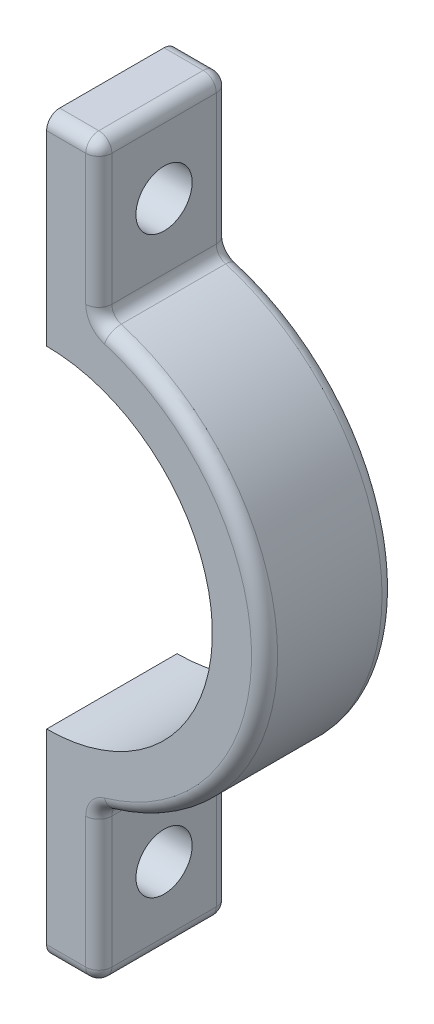
ISO-10303-21;
HEADER;
FILE_DESCRIPTION(('STEP AP214'),'2;1');
FILE_NAME('part.step','',(''),(''),'','','');
FILE_SCHEMA(('AUTOMOTIVE_DESIGN { 1 0 10303 214 1 1 1 1 }'));
ENDSEC;
DATA;
#1=APPLICATION_CONTEXT('core data for automotive mechanical design processes');
#2=APPLICATION_PROTOCOL_DEFINITION('international standard','automotive_design',2000,#1);
#3=PRODUCT_CONTEXT('',#1,'mechanical');
#4=PRODUCT('Part','Part','',(#3));
#5=PRODUCT_RELATED_PRODUCT_CATEGORY('part','',(#4));
#6=PRODUCT_DEFINITION_FORMATION('','',#4);
#7=PRODUCT_DEFINITION_CONTEXT('part definition',#1,'design');
#8=PRODUCT_DEFINITION('design','',#6,#7);
#9=PRODUCT_DEFINITION_SHAPE('','',#8);
#10=(LENGTH_UNIT() NAMED_UNIT(*) SI_UNIT(.MILLI.,.METRE.));
#11=(NAMED_UNIT(*) PLANE_ANGLE_UNIT() SI_UNIT($,.RADIAN.));
#12=(NAMED_UNIT(*) SI_UNIT($,.STERADIAN.) SOLID_ANGLE_UNIT());
#13=UNCERTAINTY_MEASURE_WITH_UNIT(LENGTH_MEASURE(1.E-05),#10,'distance_accuracy_value','');
#14=(GEOMETRIC_REPRESENTATION_CONTEXT(3) GLOBAL_UNCERTAINTY_ASSIGNED_CONTEXT((#13)) GLOBAL_UNIT_ASSIGNED_CONTEXT((#10,
#11,#12)) REPRESENTATION_CONTEXT('',''));
#15=CARTESIAN_POINT('',(0.,0.,0.));
#16=DIRECTION('',(0.,0.,1.));
#17=DIRECTION('',(1.,0.,0.));
#18=AXIS2_PLACEMENT_3D('',#15,#16,#17);
#19=CARTESIAN_POINT('',(0.,0.,0.));
#20=DIRECTION('',(1.,0.,0.));
#21=DIRECTION('',(0.,0.,-1.));
#22=AXIS2_PLACEMENT_3D('',#19,#20,#21);
#23=PLANE('',#22);
#24=CARTESIAN_POINT('',(0.,-22.,5.));
#25=DIRECTION('',(1.,0.,0.));
#26=DIRECTION('',(0.,0.,-1.));
#27=AXIS2_PLACEMENT_3D('',#24,#25,#26);
#28=CIRCLE('',#27,2.15264999999999);
#29=CARTESIAN_POINT('',(0.,-22.,2.84735000000001));
#30=VERTEX_POINT('',#29);
#31=EDGE_CURVE('E406',#30,#30,#28,.F.);
#32=ORIENTED_EDGE('',*,*,#31,.F.);
#33=EDGE_LOOP('',(#32));
#34=FACE_BOUND('',#33,.T.);
#35=DIRECTION('',(0.,1.,0.));
#36=VECTOR('',#35,1.);
#37=CARTESIAN_POINT('',(0.,0.,10.));
#38=LINE('',#37,#36);
#39=CARTESIAN_POINT('',(0.,-27.,10.));
#40=VERTEX_POINT('',#39);
#41=CARTESIAN_POINT('',(0.,-12.7,10.));
#42=VERTEX_POINT('',#41);
#43=EDGE_CURVE('E418',#40,#42,#38,.T.);
#44=ORIENTED_EDGE('',*,*,#43,.T.);
#45=DIRECTION('',(0.,0.,-1.));
#46=VECTOR('',#45,1.);
#47=CARTESIAN_POINT('',(0.,-12.7,10.));
#48=LINE('',#47,#46);
#49=CARTESIAN_POINT('',(0.,-12.7,0.));
#50=VERTEX_POINT('',#49);
#51=EDGE_CURVE('E43',#42,#50,#48,.T.);
#52=ORIENTED_EDGE('',*,*,#51,.T.);
#53=DIRECTION('',(0.,1.,0.));
#54=VECTOR('',#53,1.);
#55=CARTESIAN_POINT('',(0.,0.,0.));
#56=LINE('',#55,#54);
#57=CARTESIAN_POINT('',(0.,-27.,0.));
#58=VERTEX_POINT('',#57);
#59=EDGE_CURVE('E415',#58,#50,#56,.T.);
#60=ORIENTED_EDGE('',*,*,#59,.F.);
#61=CARTESIAN_POINT('',(0.,-27.,1.));
#62=DIRECTION('',(1.,0.,0.));
#63=DIRECTION('',(0.,0.,-1.));
#64=AXIS2_PLACEMENT_3D('',#61,#62,#63);
#65=CIRCLE('',#64,1.);
#66=CARTESIAN_POINT('',(0.,-28.,1.));
#67=VERTEX_POINT('',#66);
#68=EDGE_CURVE('E421',#58,#67,#65,.F.);
#69=ORIENTED_EDGE('',*,*,#68,.T.);
#70=DIRECTION('',(0.,0.,-1.));
#71=VECTOR('',#70,1.);
#72=CARTESIAN_POINT('',(0.,-28.,24.2447378124774));
#73=LINE('',#72,#71);
#74=CARTESIAN_POINT('',(0.,-28.,9.));
#75=VERTEX_POINT('',#74);
#76=EDGE_CURVE('E409',#75,#67,#73,.T.);
#77=ORIENTED_EDGE('',*,*,#76,.F.);
#78=CARTESIAN_POINT('',(0.,-27.,9.));
#79=DIRECTION('',(1.,0.,0.));
#80=DIRECTION('',(0.,0.,-1.));
#81=AXIS2_PLACEMENT_3D('',#78,#79,#80);
#82=CIRCLE('',#81,1.);
#83=EDGE_CURVE('E413',#75,#40,#82,.F.);
#84=ORIENTED_EDGE('',*,*,#83,.T.);
#85=EDGE_LOOP('',(#44,#52,#60,#69,#77,#84));
#86=FACE_BOUND('',#85,.T.);
#87=ADVANCED_FACE('F40',(#34,#86),#23,.F.);
#88=CARTESIAN_POINT('',(0.,22.,5.));
#89=DIRECTION('',(1.,0.,0.));
#90=DIRECTION('',(0.,0.,-1.));
#91=AXIS2_PLACEMENT_3D('',#88,#89,#90);
#92=CIRCLE('',#91,2.15264999999999);
#93=CARTESIAN_POINT('',(0.,22.,2.84735000000001));
#94=VERTEX_POINT('',#93);
#95=EDGE_CURVE('E319',#94,#94,#92,.F.);
#96=ORIENTED_EDGE('',*,*,#95,.F.);
#97=EDGE_LOOP('',(#96));
#98=FACE_BOUND('',#97,.T.);
#99=CARTESIAN_POINT('',(0.,12.7,10.));
#100=VERTEX_POINT('',#99);
#101=CARTESIAN_POINT('',(0.,27.,10.));
#102=VERTEX_POINT('',#101);
#103=EDGE_CURVE('E424',#100,#102,#38,.T.);
#104=ORIENTED_EDGE('',*,*,#103,.T.);
#105=CARTESIAN_POINT('',(0.,27.,9.));
#106=DIRECTION('',(1.,0.,0.));
#107=DIRECTION('',(0.,0.,-1.));
#108=AXIS2_PLACEMENT_3D('',#105,#106,#107);
#109=CIRCLE('',#108,1.);
#110=CARTESIAN_POINT('',(0.,28.,9.));
#111=VERTEX_POINT('',#110);
#112=EDGE_CURVE('E49',#102,#111,#109,.F.);
#113=ORIENTED_EDGE('',*,*,#112,.T.);
#114=DIRECTION('',(0.,0.,-1.));
#115=VECTOR('',#114,1.);
#116=CARTESIAN_POINT('',(0.,28.,24.2447378124774));
#117=LINE('',#116,#115);
#118=CARTESIAN_POINT('',(0.,28.,1.));
#119=VERTEX_POINT('',#118);
#120=EDGE_CURVE('E185',#111,#119,#117,.T.);
#121=ORIENTED_EDGE('',*,*,#120,.T.);
#122=CARTESIAN_POINT('',(0.,27.,1.));
#123=DIRECTION('',(1.,0.,0.));
#124=DIRECTION('',(0.,0.,-1.));
#125=AXIS2_PLACEMENT_3D('',#122,#123,#124);
#126=CIRCLE('',#125,1.);
#127=CARTESIAN_POINT('',(0.,27.,0.));
#128=VERTEX_POINT('',#127);
#129=EDGE_CURVE('E12',#119,#128,#126,.F.);
#130=ORIENTED_EDGE('',*,*,#129,.T.);
#131=CARTESIAN_POINT('',(0.,12.7,0.));
#132=VERTEX_POINT('',#131);
#133=EDGE_CURVE('E63',#132,#128,#56,.T.);
#134=ORIENTED_EDGE('',*,*,#133,.F.);
#135=DIRECTION('',(0.,0.,-1.));
#136=VECTOR('',#135,1.);
#137=CARTESIAN_POINT('',(0.,12.7,10.));
#138=LINE('',#137,#136);
#139=EDGE_CURVE('E414',#132,#100,#138,.F.);
#140=ORIENTED_EDGE('',*,*,#139,.T.);
#141=EDGE_LOOP('',(#104,#113,#121,#130,#134,#140));
#142=FACE_BOUND('',#141,.T.);
#143=ADVANCED_FACE('F494',(#98,#142),#23,.F.);
#144=CARTESIAN_POINT('',(0.,0.,10.));
#145=DIRECTION('',(0.,0.,-1.));
#146=DIRECTION('',(-1.,0.,0.));
#147=AXIS2_PLACEMENT_3D('',#144,#145,#146);
#148=CYLINDRICAL_SURFACE('',#147,16.7);
#149=DIRECTION('',(0.,0.,-1.));
#150=VECTOR('',#149,1.);
#151=CARTESIAN_POINT('',(4.71751412429378,-16.019833347669,10.));
#152=LINE('',#151,#150);
#153=CARTESIAN_POINT('',(4.71751412429378,-16.019833347669,9.));
#154=VERTEX_POINT('',#153);
#155=CARTESIAN_POINT('',(4.71751412429378,-16.019833347669,0.999999999999999));
#156=VERTEX_POINT('',#155);
#157=EDGE_CURVE('E290',#154,#156,#152,.T.);
#158=ORIENTED_EDGE('',*,*,#157,.T.);
#159=CARTESIAN_POINT('',(0.,0.,0.999999999999999));
#160=DIRECTION('',(0.,0.,1.));
#161=DIRECTION('',(1.,0.,0.));
#162=AXIS2_PLACEMENT_3D('',#159,#160,#161);
#163=CIRCLE('',#162,16.7);
#164=CARTESIAN_POINT('',(4.71751412429378,16.019833347669,0.999999999999999));
#165=VERTEX_POINT('',#164);
#166=EDGE_CURVE('E294',#156,#165,#163,.T.);
#167=ORIENTED_EDGE('',*,*,#166,.T.);
#168=DIRECTION('',(0.,0.,-1.));
#169=VECTOR('',#168,1.);
#170=CARTESIAN_POINT('',(4.71751412429378,16.019833347669,10.));
#171=LINE('',#170,#169);
#172=CARTESIAN_POINT('',(4.71751412429378,16.019833347669,9.));
#173=VERTEX_POINT('',#172);
#174=EDGE_CURVE('E287',#165,#173,#171,.F.);
#175=ORIENTED_EDGE('',*,*,#174,.T.);
#176=CARTESIAN_POINT('',(0.,0.,9.));
#177=DIRECTION('',(0.,0.,1.));
#178=DIRECTION('',(1.,0.,0.));
#179=AXIS2_PLACEMENT_3D('',#176,#177,#178);
#180=CIRCLE('',#179,16.7);
#181=EDGE_CURVE('E284',#173,#154,#180,.F.);
#182=ORIENTED_EDGE('',*,*,#181,.T.);
#183=EDGE_LOOP('',(#158,#167,#175,#182));
#184=FACE_BOUND('',#183,.T.);
#185=ADVANCED_FACE('F499',(#184),#148,.T.);
#186=CARTESIAN_POINT('',(5.,-16.9791048056133,10.));
#187=DIRECTION('',(0.,0.,-1.));
#188=DIRECTION('',(-1.,0.,0.));
#189=AXIS2_PLACEMENT_3D('',#186,#187,#188);
#190=CYLINDRICAL_SURFACE('',#189,1.);
#191=CARTESIAN_POINT('',(5.,-16.9791048056133,9.));
#192=DIRECTION('',(0.,0.,1.));
#193=DIRECTION('',(1.,0.,0.));
#194=AXIS2_PLACEMENT_3D('',#191,#192,#193);
#195=CIRCLE('',#194,1.);
#196=CARTESIAN_POINT('',(4.,-16.9791048056133,9.));
#197=VERTEX_POINT('',#196);
#198=EDGE_CURVE('E374',#197,#154,#195,.F.);
#199=ORIENTED_EDGE('',*,*,#198,.F.);
#200=DIRECTION('',(0.,0.,1.));
#201=VECTOR('',#200,1.);
#202=CARTESIAN_POINT('',(4.,-16.9791048056133,10.));
#203=LINE('',#202,#201);
#204=CARTESIAN_POINT('',(4.,-16.9791048056133,1.));
#205=VERTEX_POINT('',#204);
#206=EDGE_CURVE('E250',#205,#197,#203,.T.);
#207=ORIENTED_EDGE('',*,*,#206,.F.);
#208=CARTESIAN_POINT('',(5.,-16.9791048056133,0.999999999999999));
#209=DIRECTION('',(0.,0.,1.));
#210=DIRECTION('',(1.,0.,0.));
#211=AXIS2_PLACEMENT_3D('',#208,#209,#210);
#212=CIRCLE('',#211,1.);
#213=EDGE_CURVE('E362',#156,#205,#212,.T.);
#214=ORIENTED_EDGE('',*,*,#213,.F.);
#215=ORIENTED_EDGE('',*,*,#157,.F.);
#216=EDGE_LOOP('',(#199,#207,#214,#215));
#217=FACE_BOUND('',#216,.T.);
#218=ADVANCED_FACE('F546',(#217),#190,.F.);
#219=CARTESIAN_POINT('',(5.,16.9791048056133,10.));
#220=DIRECTION('',(0.,0.,-1.));
#221=DIRECTION('',(-1.,0.,0.));
#222=AXIS2_PLACEMENT_3D('',#219,#220,#221);
#223=CYLINDRICAL_SURFACE('',#222,1.);
#224=CARTESIAN_POINT('',(5.,16.9791048056133,9.));
#225=DIRECTION('',(0.,0.,1.));
#226=DIRECTION('',(1.,0.,0.));
#227=AXIS2_PLACEMENT_3D('',#224,#225,#226);
#228=CIRCLE('',#227,1.);
#229=CARTESIAN_POINT('',(4.,16.9791048056133,9.));
#230=VERTEX_POINT('',#229);
#231=EDGE_CURVE('E350',#173,#230,#228,.F.);
#232=ORIENTED_EDGE('',*,*,#231,.F.);
#233=ORIENTED_EDGE('',*,*,#174,.F.);
#234=CARTESIAN_POINT('',(5.,16.9791048056133,0.999999999999999));
#235=DIRECTION('',(0.,0.,1.));
#236=DIRECTION('',(1.,0.,0.));
#237=AXIS2_PLACEMENT_3D('',#234,#235,#236);
#238=CIRCLE('',#237,1.);
#239=CARTESIAN_POINT('',(4.,16.9791048056133,1.));
#240=VERTEX_POINT('',#239);
#241=EDGE_CURVE('E338',#240,#165,#238,.T.);
#242=ORIENTED_EDGE('',*,*,#241,.F.);
#243=DIRECTION('',(0.,0.,-1.));
#244=VECTOR('',#243,1.);
#245=CARTESIAN_POINT('',(4.,16.9791048056133,24.2447378124774));
#246=LINE('',#245,#244);
#247=EDGE_CURVE('E221',#230,#240,#246,.T.);
#248=ORIENTED_EDGE('',*,*,#247,.F.);
#249=EDGE_LOOP('',(#232,#233,#242,#248));
#250=FACE_BOUND('',#249,.T.);
#251=ADVANCED_FACE('F553',(#250),#223,.F.);
#252=CARTESIAN_POINT('',(3.,28.,9.));
#253=DIRECTION('',(0.,-1.,0.));
#254=DIRECTION('',(1.,0.,0.));
#255=AXIS2_PLACEMENT_3D('',#252,#253,#254);
#256=CYLINDRICAL_SURFACE('',#255,1.);
#257=CARTESIAN_POINT('',(3.,16.9791048056133,9.));
#258=DIRECTION('',(0.,-1.,0.));
#259=DIRECTION('',(0.,0.,-1.));
#260=AXIS2_PLACEMENT_3D('',#257,#258,#259);
#261=CIRCLE('',#260,1.);
#262=CARTESIAN_POINT('',(3.,16.9791048056133,10.));
#263=VERTEX_POINT('',#262);
#264=EDGE_CURVE('E334',#263,#230,#261,.F.);
#265=ORIENTED_EDGE('',*,*,#264,.T.);
#266=DIRECTION('',(0.,-1.,0.));
#267=VECTOR('',#266,1.);
#268=CARTESIAN_POINT('',(4.,28.,9.));
#269=LINE('',#268,#267);
#270=CARTESIAN_POINT('',(4.,27.,9.));
#271=VERTEX_POINT('',#270);
#272=EDGE_CURVE('E227',#271,#230,#269,.T.);
#273=ORIENTED_EDGE('',*,*,#272,.F.);
#274=CARTESIAN_POINT('',(3.,27.,9.));
#275=DIRECTION('',(0.,1.,0.));
#276=DIRECTION('',(0.,0.,1.));
#277=AXIS2_PLACEMENT_3D('',#274,#275,#276);
#278=CIRCLE('',#277,1.);
#279=CARTESIAN_POINT('',(3.,27.,10.));
#280=VERTEX_POINT('',#279);
#281=EDGE_CURVE('E202',#280,#271,#278,.T.);
#282=ORIENTED_EDGE('',*,*,#281,.F.);
#283=DIRECTION('',(0.,-1.,0.));
#284=VECTOR('',#283,1.);
#285=CARTESIAN_POINT('',(2.99999999999999,0.,10.));
#286=LINE('',#285,#284);
#287=EDGE_CURVE('E299',#263,#280,#286,.F.);
#288=ORIENTED_EDGE('',*,*,#287,.F.);
#289=EDGE_LOOP('',(#265,#273,#282,#288));
#290=FACE_BOUND('',#289,.T.);
#291=ADVANCED_FACE('F473',(#290),#256,.T.);
#292=CARTESIAN_POINT('',(5.,16.9791048056133,9.));
#293=DIRECTION('',(0.,0.,1.));
#294=DIRECTION('',(1.,0.,0.));
#295=AXIS2_PLACEMENT_3D('',#292,#293,#294);
#296=TOROIDAL_SURFACE('',#295,2.,1.);
#297=CARTESIAN_POINT('',(4.43502824858757,15.0605618897248,9.));
#298=DIRECTION('',(-0.959271457944253,0.282485875706215,0.));
#299=DIRECTION('',(-0.282485875706215,-0.959271457944253,0.));
#300=AXIS2_PLACEMENT_3D('',#297,#298,#299);
#301=CIRCLE('',#300,1.);
#302=CARTESIAN_POINT('',(4.43502824858757,15.0605618897248,10.));
#303=VERTEX_POINT('',#302);
#304=EDGE_CURVE('E346',#303,#173,#301,.T.);
#305=ORIENTED_EDGE('',*,*,#304,.T.);
#306=ORIENTED_EDGE('',*,*,#231,.T.);
#307=ORIENTED_EDGE('',*,*,#264,.F.);
#308=CARTESIAN_POINT('',(5.,16.9791048056133,10.));
#309=DIRECTION('',(0.,0.,1.));
#310=DIRECTION('',(1.,0.,0.));
#311=AXIS2_PLACEMENT_3D('',#308,#309,#310);
#312=CIRCLE('',#311,2.);
#313=EDGE_CURVE('E302',#263,#303,#312,.T.);
#314=ORIENTED_EDGE('',*,*,#313,.T.);
#315=EDGE_LOOP('',(#305,#306,#307,#314));
#316=FACE_BOUND('',#315,.T.);
#317=ADVANCED_FACE('F470',(#316),#296,.T.);
#318=CARTESIAN_POINT('',(0.,0.,9.));
#319=DIRECTION('',(0.,0.,1.));
#320=DIRECTION('',(1.,0.,0.));
#321=AXIS2_PLACEMENT_3D('',#318,#319,#320);
#322=TOROIDAL_SURFACE('',#321,15.7,1.);
#323=CARTESIAN_POINT('',(4.43502824858757,-15.0605618897248,9.));
#324=DIRECTION('',(-0.959271457944253,-0.282485875706215,0.));
#325=DIRECTION('',(0.282485875706215,-0.959271457944253,0.));
#326=AXIS2_PLACEMENT_3D('',#323,#324,#325);
#327=CIRCLE('',#326,1.);
#328=CARTESIAN_POINT('',(4.43502824858757,-15.0605618897248,10.));
#329=VERTEX_POINT('',#328);
#330=EDGE_CURVE('E358',#329,#154,#327,.F.);
#331=ORIENTED_EDGE('',*,*,#330,.T.);
#332=ORIENTED_EDGE('',*,*,#181,.F.);
#333=ORIENTED_EDGE('',*,*,#304,.F.);
#334=CARTESIAN_POINT('',(0.,0.,10.));
#335=DIRECTION('',(0.,0.,1.));
#336=DIRECTION('',(1.,0.,0.));
#337=AXIS2_PLACEMENT_3D('',#334,#335,#336);
#338=CIRCLE('',#337,15.7);
#339=EDGE_CURVE('E306',#329,#303,#338,.T.);
#340=ORIENTED_EDGE('',*,*,#339,.F.);
#341=EDGE_LOOP('',(#331,#332,#333,#340));
#342=FACE_BOUND('',#341,.T.);
#343=ADVANCED_FACE('F466',(#342),#322,.T.);
#344=CARTESIAN_POINT('',(5.,-16.9791048056133,9.));
#345=DIRECTION('',(0.,0.,1.));
#346=DIRECTION('',(1.,0.,0.));
#347=AXIS2_PLACEMENT_3D('',#344,#345,#346);
#348=TOROIDAL_SURFACE('',#347,2.,1.);
#349=CARTESIAN_POINT('',(3.,-16.9791048056133,9.));
#350=DIRECTION('',(0.,1.,0.));
#351=DIRECTION('',(0.,0.,1.));
#352=AXIS2_PLACEMENT_3D('',#349,#350,#351);
#353=CIRCLE('',#352,1.);
#354=CARTESIAN_POINT('',(3.,-16.9791048056133,10.));
#355=VERTEX_POINT('',#354);
#356=EDGE_CURVE('E370',#355,#197,#353,.T.);
#357=ORIENTED_EDGE('',*,*,#356,.T.);
#358=ORIENTED_EDGE('',*,*,#198,.T.);
#359=ORIENTED_EDGE('',*,*,#330,.F.);
#360=CARTESIAN_POINT('',(5.,-16.9791048056133,10.));
#361=DIRECTION('',(0.,0.,1.));
#362=DIRECTION('',(1.,0.,0.));
#363=AXIS2_PLACEMENT_3D('',#360,#361,#362);
#364=CIRCLE('',#363,2.);
#365=EDGE_CURVE('E309',#329,#355,#364,.T.);
#366=ORIENTED_EDGE('',*,*,#365,.T.);
#367=EDGE_LOOP('',(#357,#358,#359,#366));
#368=FACE_BOUND('',#367,.T.);
#369=ADVANCED_FACE('F462',(#368),#348,.T.);
#370=CARTESIAN_POINT('',(2.99999999999999,0.,9.));
#371=DIRECTION('',(0.,-1.,0.));
#372=DIRECTION('',(1.,0.,0.));
#373=AXIS2_PLACEMENT_3D('',#370,#371,#372);
#374=CYLINDRICAL_SURFACE('',#373,1.);
#375=CARTESIAN_POINT('',(3.,-27.,9.));
#376=DIRECTION('',(0.,-1.,0.));
#377=DIRECTION('',(0.,0.,-1.));
#378=AXIS2_PLACEMENT_3D('',#375,#376,#377);
#379=CIRCLE('',#378,1.);
#380=CARTESIAN_POINT('',(3.,-27.,10.));
#381=VERTEX_POINT('',#380);
#382=CARTESIAN_POINT('',(4.,-27.,9.));
#383=VERTEX_POINT('',#382);
#384=EDGE_CURVE('E382',#381,#383,#379,.F.);
#385=ORIENTED_EDGE('',*,*,#384,.T.);
#386=DIRECTION('',(0.,1.,0.));
#387=VECTOR('',#386,1.);
#388=CARTESIAN_POINT('',(4.,-28.,9.));
#389=LINE('',#388,#387);
#390=EDGE_CURVE('E247',#197,#383,#389,.F.);
#391=ORIENTED_EDGE('',*,*,#390,.F.);
#392=ORIENTED_EDGE('',*,*,#356,.F.);
#393=DIRECTION('',(0.,1.,0.));
#394=VECTOR('',#393,1.);
#395=CARTESIAN_POINT('',(3.,-16.213882940246,10.));
#396=LINE('',#395,#394);
#397=EDGE_CURVE('E313',#381,#355,#396,.T.);
#398=ORIENTED_EDGE('',*,*,#397,.F.);
#399=EDGE_LOOP('',(#385,#391,#392,#398));
#400=FACE_BOUND('',#399,.T.);
#401=ADVANCED_FACE('F457',(#400),#374,.T.);
#402=CARTESIAN_POINT('',(3.,-28.,1.));
#403=DIRECTION('',(0.,1.,0.));
#404=DIRECTION('',(-1.,0.,0.));
#405=AXIS2_PLACEMENT_3D('',#402,#403,#404);
#406=CYLINDRICAL_SURFACE('',#405,1.);
#407=CARTESIAN_POINT('',(3.,-27.,1.));
#408=DIRECTION('',(0.,-1.,0.));
#409=DIRECTION('',(0.,0.,-1.));
#410=AXIS2_PLACEMENT_3D('',#407,#408,#409);
#411=CIRCLE('',#410,1.);
#412=CARTESIAN_POINT('',(4.,-27.,1.));
#413=VERTEX_POINT('',#412);
#414=CARTESIAN_POINT('',(3.,-27.,0.));
#415=VERTEX_POINT('',#414);
#416=EDGE_CURVE('E378',#413,#415,#411,.F.);
#417=ORIENTED_EDGE('',*,*,#416,.T.);
#418=DIRECTION('',(0.,1.,0.));
#419=VECTOR('',#418,1.);
#420=CARTESIAN_POINT('',(2.99999999999999,0.,0.));
#421=LINE('',#420,#419);
#422=CARTESIAN_POINT('',(3.,-16.9791048056133,0.));
#423=VERTEX_POINT('',#422);
#424=EDGE_CURVE('E264',#423,#415,#421,.F.);
#425=ORIENTED_EDGE('',*,*,#424,.F.);
#426=CARTESIAN_POINT('',(3.,-16.9791048056133,1.));
#427=DIRECTION('',(0.,1.,0.));
#428=DIRECTION('',(0.,0.,1.));
#429=AXIS2_PLACEMENT_3D('',#426,#427,#428);
#430=CIRCLE('',#429,1.);
#431=EDGE_CURVE('E366',#205,#423,#430,.T.);
#432=ORIENTED_EDGE('',*,*,#431,.F.);
#433=DIRECTION('',(0.,1.,0.));
#434=VECTOR('',#433,1.);
#435=CARTESIAN_POINT('',(4.,-28.,1.));
#436=LINE('',#435,#434);
#437=EDGE_CURVE('E253',#413,#205,#436,.T.);
#438=ORIENTED_EDGE('',*,*,#437,.F.);
#439=EDGE_LOOP('',(#417,#425,#432,#438));
#440=FACE_BOUND('',#439,.T.);
#441=ADVANCED_FACE('F539',(#440),#406,.T.);
#442=CARTESIAN_POINT('',(5.,-16.9791048056133,0.999999999999999));
#443=DIRECTION('',(0.,0.,1.));
#444=DIRECTION('',(1.,0.,0.));
#445=AXIS2_PLACEMENT_3D('',#442,#443,#444);
#446=TOROIDAL_SURFACE('',#445,2.,1.);
#447=ORIENTED_EDGE('',*,*,#431,.T.);
#448=CARTESIAN_POINT('',(5.,-16.9791048056133,0.));
#449=DIRECTION('',(0.,0.,1.));
#450=DIRECTION('',(1.,0.,0.));
#451=AXIS2_PLACEMENT_3D('',#448,#449,#450);
#452=CIRCLE('',#451,2.);
#453=CARTESIAN_POINT('',(4.43502824858757,-15.0605618897248,0.));
#454=VERTEX_POINT('',#453);
#455=EDGE_CURVE('E267',#423,#454,#452,.F.);
#456=ORIENTED_EDGE('',*,*,#455,.T.);
#457=CARTESIAN_POINT('',(4.43502824858757,-15.0605618897248,1.));
#458=DIRECTION('',(-0.959271457944253,-0.282485875706215,0.));
#459=DIRECTION('',(0.282485875706215,-0.959271457944253,0.));
#460=AXIS2_PLACEMENT_3D('',#457,#458,#459);
#461=CIRCLE('',#460,1.);
#462=EDGE_CURVE('E354',#156,#454,#461,.F.);
#463=ORIENTED_EDGE('',*,*,#462,.F.);
#464=ORIENTED_EDGE('',*,*,#213,.T.);
#465=EDGE_LOOP('',(#447,#456,#463,#464));
#466=FACE_BOUND('',#465,.T.);
#467=ADVANCED_FACE('F565',(#466),#446,.T.);
#468=CARTESIAN_POINT('',(0.,0.,0.999999999999999));
#469=DIRECTION('',(0.,0.,1.));
#470=DIRECTION('',(1.,0.,0.));
#471=AXIS2_PLACEMENT_3D('',#468,#469,#470);
#472=TOROIDAL_SURFACE('',#471,15.7,1.);
#473=ORIENTED_EDGE('',*,*,#462,.T.);
#474=CARTESIAN_POINT('',(0.,0.,0.));
#475=DIRECTION('',(0.,0.,1.));
#476=DIRECTION('',(1.,0.,0.));
#477=AXIS2_PLACEMENT_3D('',#474,#475,#476);
#478=CIRCLE('',#477,15.7);
#479=CARTESIAN_POINT('',(4.43502824858757,15.0605618897248,0.));
#480=VERTEX_POINT('',#479);
#481=EDGE_CURVE('E271',#480,#454,#478,.F.);
#482=ORIENTED_EDGE('',*,*,#481,.F.);
#483=CARTESIAN_POINT('',(4.43502824858757,15.0605618897248,0.999999999999999));
#484=DIRECTION('',(-0.959271457944253,0.282485875706215,0.));
#485=DIRECTION('',(-0.282485875706215,-0.959271457944253,0.));
#486=AXIS2_PLACEMENT_3D('',#483,#484,#485);
#487=CIRCLE('',#486,1.);
#488=EDGE_CURVE('E342',#165,#480,#487,.T.);
#489=ORIENTED_EDGE('',*,*,#488,.F.);
#490=ORIENTED_EDGE('',*,*,#166,.F.);
#491=EDGE_LOOP('',(#473,#482,#489,#490));
#492=FACE_BOUND('',#491,.T.);
#493=ADVANCED_FACE('F557',(#492),#472,.T.);
#494=CARTESIAN_POINT('',(5.,16.9791048056133,0.999999999999999));
#495=DIRECTION('',(0.,0.,1.));
#496=DIRECTION('',(1.,0.,0.));
#497=AXIS2_PLACEMENT_3D('',#494,#495,#496);
#498=TOROIDAL_SURFACE('',#497,2.,1.);
#499=ORIENTED_EDGE('',*,*,#488,.T.);
#500=CARTESIAN_POINT('',(5.,16.9791048056133,0.));
#501=DIRECTION('',(0.,0.,1.));
#502=DIRECTION('',(1.,0.,0.));
#503=AXIS2_PLACEMENT_3D('',#500,#501,#502);
#504=CIRCLE('',#503,2.);
#505=CARTESIAN_POINT('',(3.,16.9791048056133,0.));
#506=VERTEX_POINT('',#505);
#507=EDGE_CURVE('E274',#480,#506,#504,.F.);
#508=ORIENTED_EDGE('',*,*,#507,.T.);
#509=CARTESIAN_POINT('',(3.,16.9791048056133,1.));
#510=DIRECTION('',(0.,-1.,0.));
#511=DIRECTION('',(0.,0.,-1.));
#512=AXIS2_PLACEMENT_3D('',#509,#510,#511);
#513=CIRCLE('',#512,1.);
#514=EDGE_CURVE('E330',#240,#506,#513,.F.);
#515=ORIENTED_EDGE('',*,*,#514,.F.);
#516=ORIENTED_EDGE('',*,*,#241,.T.);
#517=EDGE_LOOP('',(#499,#508,#515,#516));
#518=FACE_BOUND('',#517,.T.);
#519=ADVANCED_FACE('F560',(#518),#498,.T.);
#520=CARTESIAN_POINT('',(2.99999999999999,0.,1.));
#521=DIRECTION('',(0.,1.,0.));
#522=DIRECTION('',(-1.,0.,0.));
#523=AXIS2_PLACEMENT_3D('',#520,#521,#522);
#524=CYLINDRICAL_SURFACE('',#523,1.);
#525=ORIENTED_EDGE('',*,*,#514,.T.);
#526=DIRECTION('',(0.,-1.,0.));
#527=VECTOR('',#526,1.);
#528=CARTESIAN_POINT('',(3.,16.213882940246,0.));
#529=LINE('',#528,#527);
#530=CARTESIAN_POINT('',(3.,27.,0.));
#531=VERTEX_POINT('',#530);
#532=EDGE_CURVE('E278',#531,#506,#529,.T.);
#533=ORIENTED_EDGE('',*,*,#532,.F.);
#534=CARTESIAN_POINT('',(3.,27.,1.));
#535=DIRECTION('',(0.,1.,0.));
#536=DIRECTION('',(0.,0.,1.));
#537=AXIS2_PLACEMENT_3D('',#534,#535,#536);
#538=CIRCLE('',#537,1.);
#539=CARTESIAN_POINT('',(4.,27.,1.));
#540=VERTEX_POINT('',#539);
#541=EDGE_CURVE('E211',#540,#531,#538,.T.);
#542=ORIENTED_EDGE('',*,*,#541,.F.);
#543=DIRECTION('',(0.,-1.,0.));
#544=VECTOR('',#543,1.);
#545=CARTESIAN_POINT('',(4.,28.,1.));
#546=LINE('',#545,#544);
#547=EDGE_CURVE('E230',#240,#540,#546,.F.);
#548=ORIENTED_EDGE('',*,*,#547,.F.);
#549=EDGE_LOOP('',(#525,#533,#542,#548));
#550=FACE_BOUND('',#549,.T.);
#551=ADVANCED_FACE('F563',(#550),#524,.T.);
#552=CARTESIAN_POINT('',(3.,27.,24.2447378124774));
#553=DIRECTION('',(0.,0.,-1.));
#554=DIRECTION('',(-1.,0.,0.));
#555=AXIS2_PLACEMENT_3D('',#552,#553,#554);
#556=CYLINDRICAL_SURFACE('',#555,1.);
#557=CARTESIAN_POINT('',(3.,27.,9.));
#558=DIRECTION('',(0.,0.,1.));
#559=DIRECTION('',(1.,0.,0.));
#560=AXIS2_PLACEMENT_3D('',#557,#558,#559);
#561=CIRCLE('',#560,1.);
#562=CARTESIAN_POINT('',(3.,28.,9.));
#563=VERTEX_POINT('',#562);
#564=EDGE_CURVE('E205',#563,#271,#561,.F.);
#565=ORIENTED_EDGE('',*,*,#564,.T.);
#566=DIRECTION('',(0.,0.,-1.));
#567=VECTOR('',#566,1.);
#568=CARTESIAN_POINT('',(4.,27.,24.2447378124774));
#569=LINE('',#568,#567);
#570=EDGE_CURVE('E233',#540,#271,#569,.F.);
#571=ORIENTED_EDGE('',*,*,#570,.F.);
#572=CARTESIAN_POINT('',(3.,27.,1.));
#573=DIRECTION('',(0.,0.,-1.));
#574=DIRECTION('',(-1.,0.,0.));
#575=AXIS2_PLACEMENT_3D('',#572,#573,#574);
#576=CIRCLE('',#575,1.);
#577=CARTESIAN_POINT('',(3.,28.,1.));
#578=VERTEX_POINT('',#577);
#579=EDGE_CURVE('E212',#540,#578,#576,.F.);
#580=ORIENTED_EDGE('',*,*,#579,.T.);
#581=DIRECTION('',(0.,0.,-1.));
#582=VECTOR('',#581,1.);
#583=CARTESIAN_POINT('',(3.,28.,24.2447378124774));
#584=LINE('',#583,#582);
#585=EDGE_CURVE('E184',#563,#578,#584,.T.);
#586=ORIENTED_EDGE('',*,*,#585,.F.);
#587=EDGE_LOOP('',(#565,#571,#580,#586));
#588=FACE_BOUND('',#587,.T.);
#589=ADVANCED_FACE('F214',(#588),#556,.T.);
#590=CARTESIAN_POINT('',(3.,-27.,24.2447378124774));
#591=DIRECTION('',(0.,0.,-1.));
#592=DIRECTION('',(-1.,0.,0.));
#593=AXIS2_PLACEMENT_3D('',#590,#591,#592);
#594=CYLINDRICAL_SURFACE('',#593,1.);
#595=CARTESIAN_POINT('',(3.,-27.,9.));
#596=DIRECTION('',(0.,0.,1.));
#597=DIRECTION('',(1.,0.,0.));
#598=AXIS2_PLACEMENT_3D('',#595,#596,#597);
#599=CIRCLE('',#598,1.);
#600=CARTESIAN_POINT('',(3.,-28.,9.));
#601=VERTEX_POINT('',#600);
#602=EDGE_CURVE('E398',#601,#383,#599,.T.);
#603=ORIENTED_EDGE('',*,*,#602,.F.);
#604=DIRECTION('',(0.,0.,-1.));
#605=VECTOR('',#604,1.);
#606=CARTESIAN_POINT('',(3.,-28.,24.2447378124774));
#607=LINE('',#606,#605);
#608=CARTESIAN_POINT('',(3.,-28.,1.));
#609=VERTEX_POINT('',#608);
#610=EDGE_CURVE('E241',#609,#601,#607,.F.);
#611=ORIENTED_EDGE('',*,*,#610,.F.);
#612=CARTESIAN_POINT('',(3.,-27.,1.));
#613=DIRECTION('',(0.,0.,-1.));
#614=DIRECTION('',(-1.,0.,0.));
#615=AXIS2_PLACEMENT_3D('',#612,#613,#614);
#616=CIRCLE('',#615,1.);
#617=EDGE_CURVE('E386',#413,#609,#616,.T.);
#618=ORIENTED_EDGE('',*,*,#617,.F.);
#619=DIRECTION('',(0.,0.,-1.));
#620=VECTOR('',#619,1.);
#621=CARTESIAN_POINT('',(4.,-27.,24.2447378124774));
#622=LINE('',#621,#620);
#623=EDGE_CURVE('E256',#383,#413,#622,.T.);
#624=ORIENTED_EDGE('',*,*,#623,.F.);
#625=EDGE_LOOP('',(#603,#611,#618,#624));
#626=FACE_BOUND('',#625,.T.);
#627=ADVANCED_FACE('F587',(#626),#594,.T.);
#628=CARTESIAN_POINT('',(3.,-27.,9.));
#629=DIRECTION('',(0.,0.,1.));
#630=DIRECTION('',(1.,0.,0.));
#631=AXIS2_PLACEMENT_3D('',#628,#629,#630);
#632=SPHERICAL_SURFACE('',#631,1.);
#633=CARTESIAN_POINT('',(3.,-27.,9.));
#634=DIRECTION('',(1.,0.,0.));
#635=DIRECTION('',(0.,0.,-1.));
#636=AXIS2_PLACEMENT_3D('',#633,#634,#635);
#637=CIRCLE('',#636,1.);
#638=EDGE_CURVE('E394',#381,#601,#637,.T.);
#639=ORIENTED_EDGE('',*,*,#638,.T.);
#640=ORIENTED_EDGE('',*,*,#602,.T.);
#641=ORIENTED_EDGE('',*,*,#384,.F.);
#642=EDGE_LOOP('',(#639,#640,#641));
#643=FACE_BOUND('',#642,.T.);
#644=ADVANCED_FACE('F453',(#643),#632,.T.);
#645=CARTESIAN_POINT('',(4.,-28.,24.2447378124774));
#646=DIRECTION('',(0.,1.,0.));
#647=DIRECTION('',(0.,0.,1.));
#648=AXIS2_PLACEMENT_3D('',#645,#646,#647);
#649=PLANE('',#648);
#650=DIRECTION('',(1.,0.,0.));
#651=VECTOR('',#650,1.);
#652=CARTESIAN_POINT('',(-4.,-28.,9.));
#653=LINE('',#652,#651);
#654=EDGE_CURVE('E237',#601,#75,#653,.F.);
#655=ORIENTED_EDGE('',*,*,#654,.T.);
#656=ORIENTED_EDGE('',*,*,#76,.T.);
#657=DIRECTION('',(1.,0.,0.));
#658=VECTOR('',#657,1.);
#659=CARTESIAN_POINT('',(4.,-28.,1.));
#660=LINE('',#659,#658);
#661=EDGE_CURVE('E244',#67,#609,#660,.T.);
#662=ORIENTED_EDGE('',*,*,#661,.T.);
#663=ORIENTED_EDGE('',*,*,#610,.T.);
#664=EDGE_LOOP('',(#655,#656,#662,#663));
#665=FACE_BOUND('',#664,.T.);
#666=ADVANCED_FACE('F584',(#665),#649,.F.);
#667=CARTESIAN_POINT('',(3.,-27.,1.));
#668=DIRECTION('',(0.,0.,1.));
#669=DIRECTION('',(1.,0.,0.));
#670=AXIS2_PLACEMENT_3D('',#667,#668,#669);
#671=SPHERICAL_SURFACE('',#670,1.);
#672=ORIENTED_EDGE('',*,*,#617,.T.);
#673=CARTESIAN_POINT('',(3.,-27.,1.));
#674=DIRECTION('',(1.,0.,0.));
#675=DIRECTION('',(0.,0.,-1.));
#676=AXIS2_PLACEMENT_3D('',#673,#674,#675);
#677=CIRCLE('',#676,1.);
#678=EDGE_CURVE('E390',#609,#415,#677,.T.);
#679=ORIENTED_EDGE('',*,*,#678,.T.);
#680=ORIENTED_EDGE('',*,*,#416,.F.);
#681=EDGE_LOOP('',(#672,#679,#680));
#682=FACE_BOUND('',#681,.T.);
#683=ADVANCED_FACE('F536',(#682),#671,.T.);
#684=CARTESIAN_POINT('',(0.,0.,0.));
#685=DIRECTION('',(0.,0.,1.));
#686=DIRECTION('',(1.,0.,0.));
#687=AXIS2_PLACEMENT_3D('',#684,#685,#686);
#688=PLANE('',#687);
#689=DIRECTION('',(1.,0.,0.));
#690=VECTOR('',#689,1.);
#691=CARTESIAN_POINT('',(0.,-27.,0.));
#692=LINE('',#691,#690);
#693=EDGE_CURVE('E260',#415,#58,#692,.F.);
#694=ORIENTED_EDGE('',*,*,#693,.T.);
#695=ORIENTED_EDGE('',*,*,#59,.T.);
#696=CARTESIAN_POINT('',(0.,0.,0.));
#697=DIRECTION('',(0.,0.,1.));
#698=DIRECTION('',(1.,0.,0.));
#699=AXIS2_PLACEMENT_3D('',#696,#697,#698);
#700=CIRCLE('',#699,12.7);
#701=EDGE_CURVE('E402',#50,#132,#700,.T.);
#702=ORIENTED_EDGE('',*,*,#701,.T.);
#703=ORIENTED_EDGE('',*,*,#133,.T.);
#704=DIRECTION('',(1.,0.,0.));
#705=VECTOR('',#704,1.);
#706=CARTESIAN_POINT('',(4.,27.,0.));
#707=LINE('',#706,#705);
#708=EDGE_CURVE('E281',#128,#531,#707,.T.);
#709=ORIENTED_EDGE('',*,*,#708,.T.);
#710=ORIENTED_EDGE('',*,*,#532,.T.);
#711=ORIENTED_EDGE('',*,*,#507,.F.);
#712=ORIENTED_EDGE('',*,*,#481,.T.);
#713=ORIENTED_EDGE('',*,*,#455,.F.);
#714=ORIENTED_EDGE('',*,*,#424,.T.);
#715=EDGE_LOOP('',(#694,#695,#702,#703,#709,#710,#711,#712,#713,#714));
#716=FACE_BOUND('',#715,.T.);
#717=ADVANCED_FACE('F521',(#716),#688,.F.);
#718=CARTESIAN_POINT('',(3.,27.,1.));
#719=DIRECTION('',(0.,0.,1.));
#720=DIRECTION('',(1.,0.,0.));
#721=AXIS2_PLACEMENT_3D('',#718,#719,#720);
#722=SPHERICAL_SURFACE('',#721,1.);
#723=ORIENTED_EDGE('',*,*,#541,.T.);
#724=CARTESIAN_POINT('',(3.,27.,1.));
#725=DIRECTION('',(1.,0.,0.));
#726=DIRECTION('',(0.,0.,-1.));
#727=AXIS2_PLACEMENT_3D('',#724,#725,#726);
#728=CIRCLE('',#727,1.);
#729=EDGE_CURVE('E203',#531,#578,#728,.T.);
#730=ORIENTED_EDGE('',*,*,#729,.T.);
#731=ORIENTED_EDGE('',*,*,#579,.F.);
#732=EDGE_LOOP('',(#723,#730,#731));
#733=FACE_BOUND('',#732,.T.);
#734=ADVANCED_FACE('F480',(#733),#722,.T.);
#735=CARTESIAN_POINT('',(4.,28.,24.2447378124774));
#736=DIRECTION('',(0.,1.,0.));
#737=DIRECTION('',(0.,0.,1.));
#738=AXIS2_PLACEMENT_3D('',#735,#736,#737);
#739=PLANE('',#738);
#740=ORIENTED_EDGE('',*,*,#120,.F.);
#741=DIRECTION('',(1.,0.,0.));
#742=VECTOR('',#741,1.);
#743=CARTESIAN_POINT('',(4.,28.,9.));
#744=LINE('',#743,#742);
#745=EDGE_CURVE('E179',#111,#563,#744,.T.);
#746=ORIENTED_EDGE('',*,*,#745,.T.);
#747=ORIENTED_EDGE('',*,*,#585,.T.);
#748=DIRECTION('',(1.,0.,0.));
#749=VECTOR('',#748,1.);
#750=CARTESIAN_POINT('',(-4.,28.,1.));
#751=LINE('',#750,#749);
#752=EDGE_CURVE('E218',#578,#119,#751,.F.);
#753=ORIENTED_EDGE('',*,*,#752,.T.);
#754=EDGE_LOOP('',(#740,#746,#747,#753));
#755=FACE_BOUND('',#754,.T.);
#756=ADVANCED_FACE('F181',(#755),#739,.T.);
#757=CARTESIAN_POINT('',(0.,27.,1.));
#758=DIRECTION('',(-1.,0.,0.));
#759=DIRECTION('',(0.,0.,1.));
#760=AXIS2_PLACEMENT_3D('',#757,#758,#759);
#761=CYLINDRICAL_SURFACE('',#760,1.);
#762=ORIENTED_EDGE('',*,*,#129,.F.);
#763=ORIENTED_EDGE('',*,*,#752,.F.);
#764=ORIENTED_EDGE('',*,*,#729,.F.);
#765=ORIENTED_EDGE('',*,*,#708,.F.);
#766=EDGE_LOOP('',(#762,#763,#764,#765));
#767=FACE_BOUND('',#766,.T.);
#768=ADVANCED_FACE('F482',(#767),#761,.T.);
#769=CARTESIAN_POINT('',(3.,27.,9.));
#770=DIRECTION('',(0.,0.,1.));
#771=DIRECTION('',(1.,0.,0.));
#772=AXIS2_PLACEMENT_3D('',#769,#770,#771);
#773=SPHERICAL_SURFACE('',#772,1.);
#774=CARTESIAN_POINT('',(3.,27.,9.));
#775=DIRECTION('',(1.,0.,0.));
#776=DIRECTION('',(0.,0.,-1.));
#777=AXIS2_PLACEMENT_3D('',#774,#775,#776);
#778=CIRCLE('',#777,1.);
#779=EDGE_CURVE('E193',#563,#280,#778,.T.);
#780=ORIENTED_EDGE('',*,*,#779,.T.);
#781=ORIENTED_EDGE('',*,*,#281,.T.);
#782=ORIENTED_EDGE('',*,*,#564,.F.);
#783=EDGE_LOOP('',(#780,#781,#782));
#784=FACE_BOUND('',#783,.T.);
#785=ADVANCED_FACE('F206',(#784),#773,.T.);
#786=CARTESIAN_POINT('',(0.,0.,10.));
#787=DIRECTION('',(0.,0.,1.));
#788=DIRECTION('',(1.,0.,0.));
#789=AXIS2_PLACEMENT_3D('',#786,#787,#788);
#790=PLANE('',#789);
#791=ORIENTED_EDGE('',*,*,#43,.F.);
#792=DIRECTION('',(1.,0.,0.));
#793=VECTOR('',#792,1.);
#794=CARTESIAN_POINT('',(4.,-27.,10.));
#795=LINE('',#794,#793);
#796=EDGE_CURVE('E316',#40,#381,#795,.T.);
#797=ORIENTED_EDGE('',*,*,#796,.T.);
#798=ORIENTED_EDGE('',*,*,#397,.T.);
#799=ORIENTED_EDGE('',*,*,#365,.F.);
#800=ORIENTED_EDGE('',*,*,#339,.T.);
#801=ORIENTED_EDGE('',*,*,#313,.F.);
#802=ORIENTED_EDGE('',*,*,#287,.T.);
#803=DIRECTION('',(1.,0.,0.));
#804=VECTOR('',#803,1.);
#805=CARTESIAN_POINT('',(0.,27.,10.));
#806=LINE('',#805,#804);
#807=EDGE_CURVE('E197',#280,#102,#806,.F.);
#808=ORIENTED_EDGE('',*,*,#807,.T.);
#809=ORIENTED_EDGE('',*,*,#103,.F.);
#810=CARTESIAN_POINT('',(0.,0.,10.));
#811=DIRECTION('',(0.,0.,1.));
#812=DIRECTION('',(1.,0.,0.));
#813=AXIS2_PLACEMENT_3D('',#810,#811,#812);
#814=CIRCLE('',#813,12.7);
#815=EDGE_CURVE('E189',#42,#100,#814,.T.);
#816=ORIENTED_EDGE('',*,*,#815,.F.);
#817=EDGE_LOOP('',(#791,#797,#798,#799,#800,#801,#802,#808,#809,#816));
#818=FACE_BOUND('',#817,.T.);
#819=ADVANCED_FACE('F443',(#818),#790,.T.);
#820=CARTESIAN_POINT('',(4.,27.,9.));
#821=DIRECTION('',(1.,0.,0.));
#822=DIRECTION('',(0.,0.,-1.));
#823=AXIS2_PLACEMENT_3D('',#820,#821,#822);
#824=CYLINDRICAL_SURFACE('',#823,1.);
#825=ORIENTED_EDGE('',*,*,#112,.F.);
#826=ORIENTED_EDGE('',*,*,#807,.F.);
#827=ORIENTED_EDGE('',*,*,#779,.F.);
#828=ORIENTED_EDGE('',*,*,#745,.F.);
#829=EDGE_LOOP('',(#825,#826,#827,#828));
#830=FACE_BOUND('',#829,.T.);
#831=ADVANCED_FACE('F195',(#830),#824,.T.);
#832=CARTESIAN_POINT('',(4.,-27.,1.));
#833=DIRECTION('',(1.,0.,0.));
#834=DIRECTION('',(0.,0.,-1.));
#835=AXIS2_PLACEMENT_3D('',#832,#833,#834);
#836=CYLINDRICAL_SURFACE('',#835,1.);
#837=ORIENTED_EDGE('',*,*,#68,.F.);
#838=ORIENTED_EDGE('',*,*,#693,.F.);
#839=ORIENTED_EDGE('',*,*,#678,.F.);
#840=ORIENTED_EDGE('',*,*,#661,.F.);
#841=EDGE_LOOP('',(#837,#838,#839,#840));
#842=FACE_BOUND('',#841,.T.);
#843=ADVANCED_FACE('F533',(#842),#836,.T.);
#844=CARTESIAN_POINT('',(0.,-27.,9.));
#845=DIRECTION('',(-1.,0.,0.));
#846=DIRECTION('',(0.,0.,1.));
#847=AXIS2_PLACEMENT_3D('',#844,#845,#846);
#848=CYLINDRICAL_SURFACE('',#847,1.);
#849=ORIENTED_EDGE('',*,*,#83,.F.);
#850=ORIENTED_EDGE('',*,*,#654,.F.);
#851=ORIENTED_EDGE('',*,*,#638,.F.);
#852=ORIENTED_EDGE('',*,*,#796,.F.);
#853=EDGE_LOOP('',(#849,#850,#851,#852));
#854=FACE_BOUND('',#853,.T.);
#855=ADVANCED_FACE('F448',(#854),#848,.T.);
#856=CARTESIAN_POINT('',(0.,0.,10.));
#857=DIRECTION('',(0.,0.,-1.));
#858=DIRECTION('',(-1.,0.,0.));
#859=AXIS2_PLACEMENT_3D('',#856,#857,#858);
#860=CYLINDRICAL_SURFACE('',#859,12.7);
#861=ORIENTED_EDGE('',*,*,#51,.F.);
#862=ORIENTED_EDGE('',*,*,#815,.T.);
#863=ORIENTED_EDGE('',*,*,#139,.F.);
#864=ORIENTED_EDGE('',*,*,#701,.F.);
#865=EDGE_LOOP('',(#861,#862,#863,#864));
#866=FACE_BOUND('',#865,.T.);
#867=ADVANCED_FACE('F524',(#866),#860,.F.);
#868=CARTESIAN_POINT('',(4.,28.,24.2447378124774));
#869=DIRECTION('',(1.,0.,0.));
#870=DIRECTION('',(0.,1.,0.));
#871=AXIS2_PLACEMENT_3D('',#868,#869,#870);
#872=PLANE('',#871);
#873=CARTESIAN_POINT('',(4.00000000000002,22.,5.));
#874=DIRECTION('',(-1.,0.,0.));
#875=DIRECTION('',(0.,0.,1.));
#876=AXIS2_PLACEMENT_3D('',#873,#874,#875);
#877=CIRCLE('',#876,2.15265);
#878=CARTESIAN_POINT('',(4.00000000000002,22.,7.15265));
#879=VERTEX_POINT('',#878);
#880=EDGE_CURVE('E512',#879,#879,#877,.T.);
#881=ORIENTED_EDGE('',*,*,#880,.T.);
#882=EDGE_LOOP('',(#881));
#883=FACE_BOUND('',#882,.T.);
#884=ORIENTED_EDGE('',*,*,#547,.T.);
#885=ORIENTED_EDGE('',*,*,#570,.T.);
#886=ORIENTED_EDGE('',*,*,#272,.T.);
#887=ORIENTED_EDGE('',*,*,#247,.T.);
#888=EDGE_LOOP('',(#884,#885,#886,#887));
#889=FACE_BOUND('',#888,.T.);
#890=ADVANCED_FACE('F476',(#883,#889),#872,.T.);
#891=CARTESIAN_POINT('',(-4.,22.,5.));
#892=DIRECTION('',(-1.,0.,0.));
#893=DIRECTION('',(0.,0.,1.));
#894=AXIS2_PLACEMENT_3D('',#891,#892,#893);
#895=CYLINDRICAL_SURFACE('',#894,2.15264999999999);
#896=ORIENTED_EDGE('',*,*,#95,.T.);
#897=EDGE_LOOP('',(#896));
#898=FACE_BOUND('',#897,.T.);
#899=ORIENTED_EDGE('',*,*,#880,.F.);
#900=EDGE_LOOP('',(#899));
#901=FACE_BOUND('',#900,.T.);
#902=ADVANCED_FACE('F600',(#898,#901),#895,.F.);
#903=CARTESIAN_POINT('',(4.,-28.,24.2447378124774));
#904=DIRECTION('',(-1.,0.,0.));
#905=DIRECTION('',(0.,-1.,0.));
#906=AXIS2_PLACEMENT_3D('',#903,#904,#905);
#907=PLANE('',#906);
#908=CARTESIAN_POINT('',(4.,-22.,5.));
#909=DIRECTION('',(-1.,0.,0.));
#910=DIRECTION('',(0.,-1.,0.));
#911=AXIS2_PLACEMENT_3D('',#908,#909,#910);
#912=CIRCLE('',#911,2.15264999999999);
#913=CARTESIAN_POINT('',(4.,-24.15265,5.));
#914=VERTEX_POINT('',#913);
#915=EDGE_CURVE('E321',#914,#914,#912,.F.);
#916=ORIENTED_EDGE('',*,*,#915,.F.);
#917=EDGE_LOOP('',(#916));
#918=FACE_BOUND('',#917,.T.);
#919=ORIENTED_EDGE('',*,*,#390,.T.);
#920=ORIENTED_EDGE('',*,*,#623,.T.);
#921=ORIENTED_EDGE('',*,*,#437,.T.);
#922=ORIENTED_EDGE('',*,*,#206,.T.);
#923=EDGE_LOOP('',(#919,#920,#921,#922));
#924=FACE_BOUND('',#923,.T.);
#925=ADVANCED_FACE('F506',(#918,#924),#907,.F.);
#926=CARTESIAN_POINT('',(-4.,-22.,5.));
#927=DIRECTION('',(-1.,0.,0.));
#928=DIRECTION('',(0.,0.,1.));
#929=AXIS2_PLACEMENT_3D('',#926,#927,#928);
#930=CYLINDRICAL_SURFACE('',#929,2.15264999999999);
#931=ORIENTED_EDGE('',*,*,#31,.T.);
#932=EDGE_LOOP('',(#931));
#933=FACE_BOUND('',#932,.T.);
#934=ORIENTED_EDGE('',*,*,#915,.T.);
#935=EDGE_LOOP('',(#934));
#936=FACE_BOUND('',#935,.T.);
#937=ADVANCED_FACE('F501',(#933,#936),#930,.F.);
#938=CLOSED_SHELL('',(#87,#143,#185,#218,#251,#291,#317,#343,#369,#401,#441,#467,#493,#519,#551,
#589,#627,#644,#666,#683,#717,#734,#756,#768,#785,#819,#831,#843,#855,#867,#890,#902,#925,#937));
#939=MANIFOLD_SOLID_BREP('B2',#938);
#940=ADVANCED_BREP_SHAPE_REPRESENTATION('',(#18,#939),#14);
#941=SHAPE_DEFINITION_REPRESENTATION(#9,#940);
ENDSEC;
END-ISO-10303-21;
